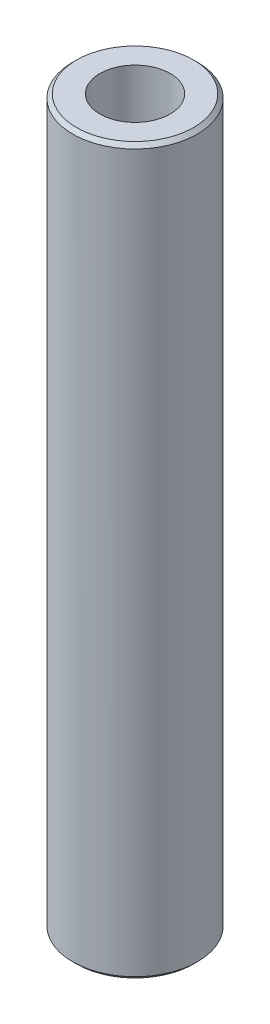
ISO-10303-21;
HEADER;
FILE_DESCRIPTION(('STEP AP214'),'2;1');
FILE_NAME('part.step','',(''),(''),'','','');
FILE_SCHEMA(('AUTOMOTIVE_DESIGN { 1 0 10303 214 1 1 1 1 }'));
ENDSEC;
DATA;
#1=APPLICATION_CONTEXT('core data for automotive mechanical design processes');
#2=APPLICATION_PROTOCOL_DEFINITION('international standard','automotive_design',2000,#1);
#3=PRODUCT_CONTEXT('',#1,'mechanical');
#4=PRODUCT('Part','Part','',(#3));
#5=PRODUCT_RELATED_PRODUCT_CATEGORY('part','',(#4));
#6=PRODUCT_DEFINITION_FORMATION('','',#4);
#7=PRODUCT_DEFINITION_CONTEXT('part definition',#1,'design');
#8=PRODUCT_DEFINITION('design','',#6,#7);
#9=PRODUCT_DEFINITION_SHAPE('','',#8);
#10=(LENGTH_UNIT() NAMED_UNIT(*) SI_UNIT(.MILLI.,.METRE.));
#11=(NAMED_UNIT(*) PLANE_ANGLE_UNIT() SI_UNIT($,.RADIAN.));
#12=(NAMED_UNIT(*) SI_UNIT($,.STERADIAN.) SOLID_ANGLE_UNIT());
#13=UNCERTAINTY_MEASURE_WITH_UNIT(LENGTH_MEASURE(1.E-05),#10,'distance_accuracy_value','');
#14=(GEOMETRIC_REPRESENTATION_CONTEXT(3) GLOBAL_UNCERTAINTY_ASSIGNED_CONTEXT((#13)) GLOBAL_UNIT_ASSIGNED_CONTEXT((#10,
#11,#12)) REPRESENTATION_CONTEXT('',''));
#15=CARTESIAN_POINT('',(0.,0.,0.));
#16=DIRECTION('',(0.,0.,1.));
#17=DIRECTION('',(1.,0.,0.));
#18=AXIS2_PLACEMENT_3D('',#15,#16,#17);
#19=CARTESIAN_POINT('',(0.,522.837022470598,0.));
#20=DIRECTION('',(0.,-1.,0.));
#21=DIRECTION('',(0.,0.,-1.));
#22=AXIS2_PLACEMENT_3D('',#19,#20,#21);
#23=CYLINDRICAL_SURFACE('',#22,45.);
#24=CARTESIAN_POINT('',(0.,520.095660028614,0.));
#25=DIRECTION('',(0.,1.,0.));
#26=DIRECTION('',(0.,0.,1.));
#27=AXIS2_PLACEMENT_3D('',#24,#25,#26);
#28=CIRCLE('',#27,45.);
#29=CARTESIAN_POINT('',(0.,520.095660028614,-45.0000000000001));
#30=VERTEX_POINT('',#29);
#31=EDGE_CURVE('E50',#30,#30,#28,.F.);
#32=ORIENTED_EDGE('',*,*,#31,.T.);
#33=EDGE_LOOP('',(#32));
#34=FACE_BOUND('',#33,.T.);
#35=CARTESIAN_POINT('',(0.,2.74136244198353,0.));
#36=DIRECTION('',(0.,1.,0.));
#37=DIRECTION('',(0.,0.,1.));
#38=AXIS2_PLACEMENT_3D('',#35,#36,#37);
#39=CIRCLE('',#38,45.);
#40=CARTESIAN_POINT('',(0.,2.74136244198353,45.));
#41=VERTEX_POINT('',#40);
#42=EDGE_CURVE('E51',#41,#41,#39,.T.);
#43=ORIENTED_EDGE('',*,*,#42,.T.);
#44=EDGE_LOOP('',(#43));
#45=FACE_BOUND('',#44,.T.);
#46=ADVANCED_FACE('F39',(#34,#45),#23,.T.);
#47=CARTESIAN_POINT('',(0.,522.837022470598,0.));
#48=DIRECTION('',(0.,1.,0.));
#49=DIRECTION('',(0.,0.,1.));
#50=AXIS2_PLACEMENT_3D('',#47,#48,#49);
#51=PLANE('',#50);
#52=CARTESIAN_POINT('',(0.,522.837022470598,0.));
#53=DIRECTION('',(0.,1.,0.));
#54=DIRECTION('',(0.,0.,1.));
#55=AXIS2_PLACEMENT_3D('',#52,#53,#54);
#56=CIRCLE('',#55,42.2586375580164);
#57=CARTESIAN_POINT('',(0.,522.837022470598,-42.2586375580165));
#58=VERTEX_POINT('',#57);
#59=EDGE_CURVE('E54',#58,#58,#56,.T.);
#60=ORIENTED_EDGE('',*,*,#59,.T.);
#61=EDGE_LOOP('',(#60));
#62=FACE_BOUND('',#61,.T.);
#63=CARTESIAN_POINT('',(0.,522.837022470598,0.));
#64=DIRECTION('',(0.,1.,0.));
#65=DIRECTION('',(0.,0.,1.));
#66=AXIS2_PLACEMENT_3D('',#63,#64,#65);
#67=CIRCLE('',#66,25.3594907685082);
#68=CARTESIAN_POINT('',(0.,522.837022470598,25.3594907685082));
#69=VERTEX_POINT('',#68);
#70=EDGE_CURVE('E58',#69,#69,#67,.T.);
#71=ORIENTED_EDGE('',*,*,#70,.F.);
#72=EDGE_LOOP('',(#71));
#73=FACE_BOUND('',#72,.T.);
#74=ADVANCED_FACE('F69',(#62,#73),#51,.T.);
#75=CARTESIAN_POINT('',(0.,0.,0.));
#76=DIRECTION('',(0.,1.,0.));
#77=DIRECTION('',(0.,0.,1.));
#78=AXIS2_PLACEMENT_3D('',#75,#76,#77);
#79=PLANE('',#78);
#80=CARTESIAN_POINT('',(0.,0.,0.));
#81=DIRECTION('',(0.,1.,0.));
#82=DIRECTION('',(0.,0.,1.));
#83=AXIS2_PLACEMENT_3D('',#80,#81,#82);
#84=CIRCLE('',#83,42.2586375580164);
#85=CARTESIAN_POINT('',(0.,0.,42.2586375580164));
#86=VERTEX_POINT('',#85);
#87=EDGE_CURVE('E10',#86,#86,#84,.F.);
#88=ORIENTED_EDGE('',*,*,#87,.T.);
#89=EDGE_LOOP('',(#88));
#90=FACE_BOUND('',#89,.T.);
#91=CARTESIAN_POINT('',(0.,0.,0.));
#92=DIRECTION('',(0.,1.,0.));
#93=DIRECTION('',(0.,0.,1.));
#94=AXIS2_PLACEMENT_3D('',#91,#92,#93);
#95=CIRCLE('',#94,25.3594907685082);
#96=CARTESIAN_POINT('',(0.,0.,25.3594907685082));
#97=VERTEX_POINT('',#96);
#98=EDGE_CURVE('E63',#97,#97,#95,.T.);
#99=ORIENTED_EDGE('',*,*,#98,.T.);
#100=EDGE_LOOP('',(#99));
#101=FACE_BOUND('',#100,.T.);
#102=ADVANCED_FACE('F75',(#90,#101),#79,.F.);
#103=CARTESIAN_POINT('',(0.,522.837022470598,0.));
#104=DIRECTION('',(0.,-1.,0.));
#105=DIRECTION('',(0.,0.,-1.));
#106=AXIS2_PLACEMENT_3D('',#103,#104,#105);
#107=CYLINDRICAL_SURFACE('',#106,25.3594907685082);
#108=ORIENTED_EDGE('',*,*,#70,.T.);
#109=EDGE_LOOP('',(#108));
#110=FACE_BOUND('',#109,.T.);
#111=ORIENTED_EDGE('',*,*,#98,.F.);
#112=EDGE_LOOP('',(#111));
#113=FACE_BOUND('',#112,.T.);
#114=ADVANCED_FACE('F70',(#110,#113),#107,.F.);
#115=CARTESIAN_POINT('',(0.,522.837022470598,0.));
#116=DIRECTION('',(0.,-1.,0.));
#117=DIRECTION('',(0.,0.,-1.));
#118=AXIS2_PLACEMENT_3D('',#115,#116,#117);
#119=CONICAL_SURFACE('',#118,42.2586375580164,0.785398163397442);
#120=CARTESIAN_POINT('',(0.,520.095660028614,-45.0000000000001));
#121=CARTESIAN_POINT('',(0.,520.124215887385,-44.9714441412294));
#122=CARTESIAN_POINT('',(0.,520.152771746155,-44.9428882824587));
#123=CARTESIAN_POINT('',(0.,520.209883463697,-44.8857765649174));
#124=CARTESIAN_POINT('',(0.,520.238439322467,-44.8572207061467));
#125=CARTESIAN_POINT('',(0.,520.295551040009,-44.8001089886054));
#126=CARTESIAN_POINT('',(0.,520.324106898779,-44.7715531298348));
#127=CARTESIAN_POINT('',(0.,520.381218616321,-44.7144414122934));
#128=CARTESIAN_POINT('',(0.,520.409774475091,-44.6858855535228));
#129=CARTESIAN_POINT('',(0.,520.466886192633,-44.6287738359815));
#130=CARTESIAN_POINT('',(0.,520.495442051403,-44.6002179772108));
#131=CARTESIAN_POINT('',(0.,520.552553768945,-44.5431062596695));
#132=CARTESIAN_POINT('',(0.,520.581109627715,-44.5145504008988));
#133=CARTESIAN_POINT('',(0.,520.638221345257,-44.4574386833575));
#134=CARTESIAN_POINT('',(0.,520.666777204027,-44.4288828245868));
#135=CARTESIAN_POINT('',(0.,520.723888921569,-44.3717711070455));
#136=CARTESIAN_POINT('',(0.,520.752444780339,-44.3432152482748));
#137=CARTESIAN_POINT('',(0.,520.809556497881,-44.2861035307335));
#138=CARTESIAN_POINT('',(0.,520.838112356651,-44.2575476719628));
#139=CARTESIAN_POINT('',(0.,520.895224074193,-44.2004359544215));
#140=CARTESIAN_POINT('',(0.,520.923779932963,-44.1718800956509));
#141=CARTESIAN_POINT('',(0.,520.980891650505,-44.1147683781095));
#142=CARTESIAN_POINT('',(0.,521.009447509275,-44.0862125193389));
#143=CARTESIAN_POINT('',(0.,521.066559226817,-44.0291008017975));
#144=CARTESIAN_POINT('',(0.,521.095115085587,-44.0005449430269));
#145=CARTESIAN_POINT('',(0.,521.152226803129,-43.9434332254855));
#146=CARTESIAN_POINT('',(0.,521.180782661899,-43.9148773667149));
#147=CARTESIAN_POINT('',(0.,521.237894379441,-43.8577656491736));
#148=CARTESIAN_POINT('',(0.,521.266450238211,-43.8292097904029));
#149=CARTESIAN_POINT('',(0.,521.323561955753,-43.7720980728616));
#150=CARTESIAN_POINT('',(0.,521.352117814523,-43.7435422140909));
#151=CARTESIAN_POINT('',(0.,521.409229532065,-43.6864304965496));
#152=CARTESIAN_POINT('',(0.,521.437785390835,-43.6578746377789));
#153=CARTESIAN_POINT('',(0.,521.494897108376,-43.6007629202376));
#154=CARTESIAN_POINT('',(0.,521.523452967147,-43.5722070614669));
#155=CARTESIAN_POINT('',(0.,521.580564684689,-43.5150953439256));
#156=CARTESIAN_POINT('',(0.,521.609120543459,-43.4865394851549));
#157=CARTESIAN_POINT('',(0.,521.666232261,-43.4294277676136));
#158=CARTESIAN_POINT('',(0.,521.694788119771,-43.400871908843));
#159=CARTESIAN_POINT('',(0.,521.751899837313,-43.3437601913016));
#160=CARTESIAN_POINT('',(0.,521.780455696083,-43.315204332531));
#161=CARTESIAN_POINT('',(0.,521.837567413624,-43.2580926149896));
#162=CARTESIAN_POINT('',(0.,521.866123272395,-43.229536756219));
#163=CARTESIAN_POINT('',(0.,521.923234989936,-43.1724250386777));
#164=CARTESIAN_POINT('',(0.,521.951790848707,-43.143869179907));
#165=CARTESIAN_POINT('',(0.,522.008902566248,-43.0867574623657));
#166=CARTESIAN_POINT('',(0.,522.037458425019,-43.058201603595));
#167=CARTESIAN_POINT('',(0.,522.09457014256,-43.0010898860537));
#168=CARTESIAN_POINT('',(0.,522.123126001331,-42.972534027283));
#169=CARTESIAN_POINT('',(0.,522.180237718872,-42.9154223097417));
#170=CARTESIAN_POINT('',(0.,522.208793577643,-42.886866450971));
#171=CARTESIAN_POINT('',(0.,522.265905295184,-42.8297547334297));
#172=CARTESIAN_POINT('',(0.,522.294461153955,-42.8011988746591));
#173=CARTESIAN_POINT('',(0.,522.351572871496,-42.7440871571177));
#174=CARTESIAN_POINT('',(0.,522.380128730267,-42.7155312983471));
#175=CARTESIAN_POINT('',(0.,522.437240447808,-42.6584195808057));
#176=CARTESIAN_POINT('',(0.,522.465796306579,-42.6298637220351));
#177=CARTESIAN_POINT('',(0.,522.52290802412,-42.5727520044937));
#178=CARTESIAN_POINT('',(0.,522.551463882891,-42.5441961457231));
#179=CARTESIAN_POINT('',(0.,522.608575600432,-42.4870844281818));
#180=CARTESIAN_POINT('',(0.,522.637131459203,-42.4585285694111));
#181=CARTESIAN_POINT('',(0.,522.694243176744,-42.4014168518698));
#182=CARTESIAN_POINT('',(0.,522.722799035515,-42.3728609930991));
#183=CARTESIAN_POINT('',(0.,522.779910753056,-42.3157492755578));
#184=CARTESIAN_POINT('',(0.,522.808466611827,-42.2871934167871));
#185=CARTESIAN_POINT('',(0.,522.837022470598,-42.2586375580165));
#186=B_SPLINE_CURVE_WITH_KNOTS('',3,(#120,#121,#122,#123,#124,#125,#126,#127,#128,#129,#130,
#131,#132,#133,#134,#135,#136,#137,#138,#139,#140,#141,#142,#143,#144,#145,#146,#147,#148,#149,
#150,#151,#152,#153,#154,#155,#156,#157,#158,#159,#160,#161,#162,#163,#164,#165,#166,#167,#168,
#169,#170,#171,#172,#173,#174,#175,#176,#177,#178,#179,#180,#181,#182,#183,#184,#185),
.UNSPECIFIED.,.F.,.F.,(4,2,2,2,2,2,2,2,2,2,2,2,2,2,2,2,2,2,2,2,2,2,2,2,2,2,2,2,2,2,2,2,4),(0.,
0.121152248275983,0.242304496552044,0.363456744828106,0.484608993104162,0.605761241380223,
0.726913489656206,0.848065737932268,0.969217986208329,1.09037023448439,1.21152248276045,
1.33267473103643,1.45382697931249,1.57497922758855,1.69613147586461,1.81728372414068,
1.93843597241674,2.05958822069271,2.18074046896878,2.30189271724484,2.4230449655209,
2.54419721379696,2.66534946207294,2.786501710349,2.90765395862506,3.02880620690112,
3.14995845517718,3.27111070345317,3.39226295172923,3.51341520000528,3.63456744828135,
3.75571969655741,3.87687194483347),.UNSPECIFIED.);
#187=EDGE_CURVE('BSEAM81',#30,#58,#186,.T.);
#188=ORIENTED_EDGE('',*,*,#31,.F.);
#189=ORIENTED_EDGE('',*,*,#59,.F.);
#190=ORIENTED_EDGE('',*,*,#187,.T.);
#191=ORIENTED_EDGE('',*,*,#187,.F.);
#192=EDGE_LOOP('',(#188,#190,#189,#191));
#193=FACE_BOUND('',#192,.T.);
#194=ADVANCED_FACE('F81',(#193),#119,.T.);
#195=CARTESIAN_POINT('',(0.,2.74136244198353,0.));
#196=DIRECTION('',(0.,1.,0.));
#197=DIRECTION('',(0.,0.,1.));
#198=AXIS2_PLACEMENT_3D('',#195,#196,#197);
#199=CONICAL_SURFACE('',#198,45.,0.785398163397453);
#200=ORIENTED_EDGE('',*,*,#87,.F.);
#201=EDGE_LOOP('',(#200));
#202=FACE_BOUND('',#201,.T.);
#203=ORIENTED_EDGE('',*,*,#42,.F.);
#204=EDGE_LOOP('',(#203));
#205=FACE_BOUND('',#204,.T.);
#206=ADVANCED_FACE('F45',(#202,#205),#199,.T.);
#207=CLOSED_SHELL('',(#46,#74,#102,#114,#194,#206));
#208=MANIFOLD_SOLID_BREP('B2',#207);
#209=ADVANCED_BREP_SHAPE_REPRESENTATION('',(#18,#208),#14);
#210=SHAPE_DEFINITION_REPRESENTATION(#9,#209);
ENDSEC;
END-ISO-10303-21;
